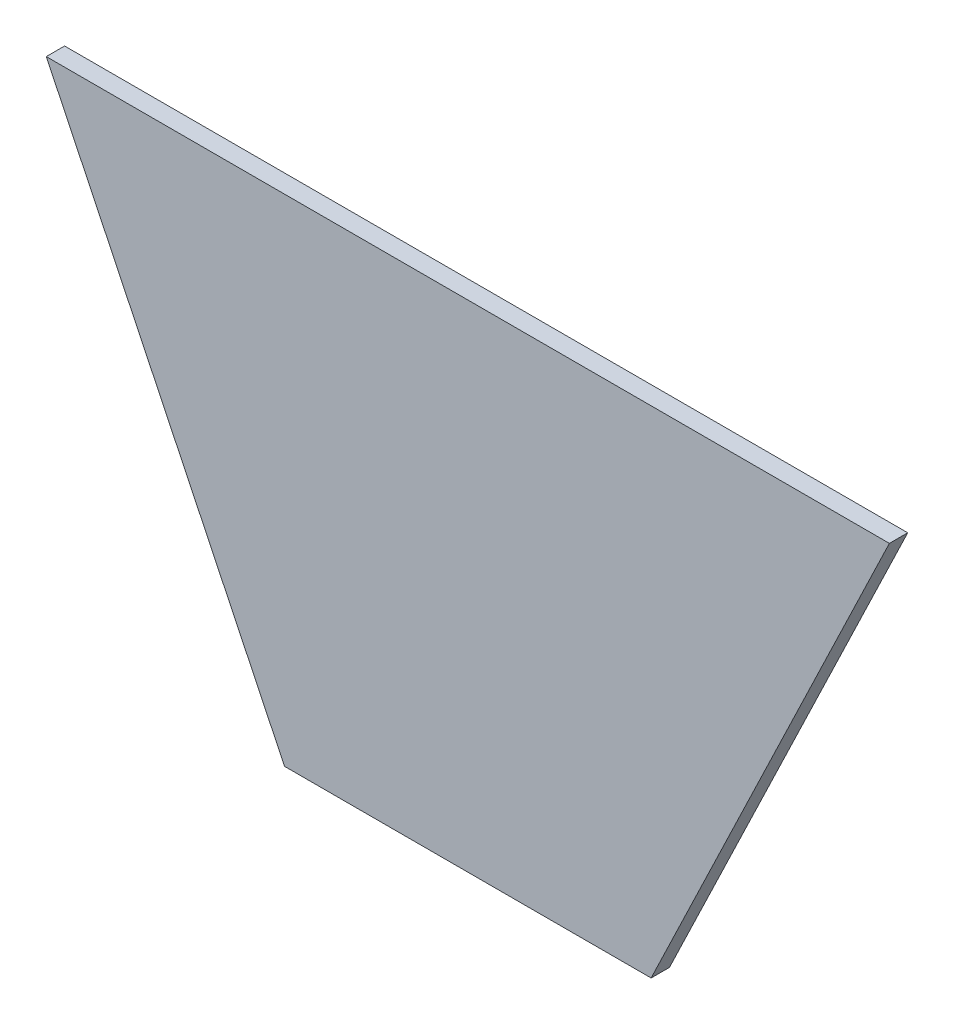
ISO-10303-21;
HEADER;
FILE_DESCRIPTION(('STEP AP214'),'2;1');
FILE_NAME('part.step','',(''),(''),'','','');
FILE_SCHEMA(('AUTOMOTIVE_DESIGN { 1 0 10303 214 1 1 1 1 }'));
ENDSEC;
DATA;
#1=APPLICATION_CONTEXT('core data for automotive mechanical design processes');
#2=APPLICATION_PROTOCOL_DEFINITION('international standard','automotive_design',2000,#1);
#3=PRODUCT_CONTEXT('',#1,'mechanical');
#4=PRODUCT('Part','Part','',(#3));
#5=PRODUCT_RELATED_PRODUCT_CATEGORY('part','',(#4));
#6=PRODUCT_DEFINITION_FORMATION('','',#4);
#7=PRODUCT_DEFINITION_CONTEXT('part definition',#1,'design');
#8=PRODUCT_DEFINITION('design','',#6,#7);
#9=PRODUCT_DEFINITION_SHAPE('','',#8);
#10=(LENGTH_UNIT() NAMED_UNIT(*) SI_UNIT(.MILLI.,.METRE.));
#11=(NAMED_UNIT(*) PLANE_ANGLE_UNIT() SI_UNIT($,.RADIAN.));
#12=(NAMED_UNIT(*) SI_UNIT($,.STERADIAN.) SOLID_ANGLE_UNIT());
#13=UNCERTAINTY_MEASURE_WITH_UNIT(LENGTH_MEASURE(1.E-05),#10,'distance_accuracy_value','');
#14=(GEOMETRIC_REPRESENTATION_CONTEXT(3) GLOBAL_UNCERTAINTY_ASSIGNED_CONTEXT((#13)) GLOBAL_UNIT_ASSIGNED_CONTEXT((#10,
#11,#12)) REPRESENTATION_CONTEXT('',''));
#15=CARTESIAN_POINT('',(0.,0.,0.));
#16=DIRECTION('',(0.,0.,1.));
#17=DIRECTION('',(1.,0.,0.));
#18=AXIS2_PLACEMENT_3D('',#15,#16,#17);
#19=CARTESIAN_POINT('',(-230.,270.370116691916,10.));
#20=DIRECTION('',(0.901233722306385,0.433333333333333,0.));
#21=DIRECTION('',(-0.433333333333333,0.901233722306385,0.));
#22=AXIS2_PLACEMENT_3D('',#19,#20,#21);
#23=PLANE('',#22);
#24=DIRECTION('',(0.433333333333333,-0.901233722306385,0.));
#25=VECTOR('',#24,1.);
#26=CARTESIAN_POINT('',(-230.,270.370116691916,0.));
#27=LINE('',#26,#25);
#28=CARTESIAN_POINT('',(-230.,270.370116691916,0.));
#29=VERTEX_POINT('',#28);
#30=CARTESIAN_POINT('',(-100.,0.,0.));
#31=VERTEX_POINT('',#30);
#32=EDGE_CURVE('E107',#29,#31,#27,.T.);
#33=ORIENTED_EDGE('',*,*,#32,.T.);
#34=DIRECTION('',(0.,0.,-1.));
#35=VECTOR('',#34,1.);
#36=CARTESIAN_POINT('',(-100.,0.,10.));
#37=LINE('',#36,#35);
#38=CARTESIAN_POINT('',(-100.,0.,10.));
#39=VERTEX_POINT('',#38);
#40=EDGE_CURVE('E11',#39,#31,#37,.T.);
#41=ORIENTED_EDGE('',*,*,#40,.F.);
#42=DIRECTION('',(0.433333333333333,-0.901233722306385,0.));
#43=VECTOR('',#42,1.);
#44=CARTESIAN_POINT('',(-230.,270.370116691916,10.));
#45=LINE('',#44,#43);
#46=CARTESIAN_POINT('',(-230.,270.370116691916,10.));
#47=VERTEX_POINT('',#46);
#48=EDGE_CURVE('E91',#47,#39,#45,.T.);
#49=ORIENTED_EDGE('',*,*,#48,.F.);
#50=DIRECTION('',(0.,0.,-1.));
#51=VECTOR('',#50,1.);
#52=CARTESIAN_POINT('',(-230.,270.370116691916,10.));
#53=LINE('',#52,#51);
#54=EDGE_CURVE('E103',#47,#29,#53,.T.);
#55=ORIENTED_EDGE('',*,*,#54,.T.);
#56=EDGE_LOOP('',(#33,#41,#49,#55));
#57=FACE_BOUND('',#56,.T.);
#58=ADVANCED_FACE('F39',(#57),#23,.F.);
#59=CARTESIAN_POINT('',(-100.,0.,10.));
#60=DIRECTION('',(0.,1.,0.));
#61=DIRECTION('',(0.,0.,1.));
#62=AXIS2_PLACEMENT_3D('',#59,#60,#61);
#63=PLANE('',#62);
#64=DIRECTION('',(1.,0.,0.));
#65=VECTOR('',#64,1.);
#66=CARTESIAN_POINT('',(-100.,0.,0.));
#67=LINE('',#66,#65);
#68=CARTESIAN_POINT('',(100.,0.,0.));
#69=VERTEX_POINT('',#68);
#70=EDGE_CURVE('E96',#31,#69,#67,.T.);
#71=ORIENTED_EDGE('',*,*,#70,.T.);
#72=DIRECTION('',(0.,0.,-1.));
#73=VECTOR('',#72,1.);
#74=CARTESIAN_POINT('',(100.,0.,10.));
#75=LINE('',#74,#73);
#76=CARTESIAN_POINT('',(100.,0.,10.));
#77=VERTEX_POINT('',#76);
#78=EDGE_CURVE('E48',#77,#69,#75,.T.);
#79=ORIENTED_EDGE('',*,*,#78,.F.);
#80=DIRECTION('',(1.,0.,0.));
#81=VECTOR('',#80,1.);
#82=CARTESIAN_POINT('',(-100.,0.,10.));
#83=LINE('',#82,#81);
#84=EDGE_CURVE('E86',#39,#77,#83,.T.);
#85=ORIENTED_EDGE('',*,*,#84,.F.);
#86=ORIENTED_EDGE('',*,*,#40,.T.);
#87=EDGE_LOOP('',(#71,#79,#85,#86));
#88=FACE_BOUND('',#87,.T.);
#89=ADVANCED_FACE('F95',(#88),#63,.F.);
#90=CARTESIAN_POINT('',(100.,0.,10.));
#91=DIRECTION('',(-0.901233722306385,0.433333333333334,0.));
#92=DIRECTION('',(-0.433333333333334,-0.901233722306385,0.));
#93=AXIS2_PLACEMENT_3D('',#90,#91,#92);
#94=PLANE('',#93);
#95=DIRECTION('',(0.433333333333334,0.901233722306385,0.));
#96=VECTOR('',#95,1.);
#97=CARTESIAN_POINT('',(100.,0.,0.));
#98=LINE('',#97,#96);
#99=CARTESIAN_POINT('',(230.,270.370116691915,0.));
#100=VERTEX_POINT('',#99);
#101=EDGE_CURVE('E73',#69,#100,#98,.T.);
#102=ORIENTED_EDGE('',*,*,#101,.T.);
#103=DIRECTION('',(0.,0.,-1.));
#104=VECTOR('',#103,1.);
#105=CARTESIAN_POINT('',(230.,270.370116691915,10.));
#106=LINE('',#105,#104);
#107=CARTESIAN_POINT('',(230.,270.370116691915,10.));
#108=VERTEX_POINT('',#107);
#109=EDGE_CURVE('E98',#108,#100,#106,.T.);
#110=ORIENTED_EDGE('',*,*,#109,.F.);
#111=DIRECTION('',(0.433333333333334,0.901233722306385,0.));
#112=VECTOR('',#111,1.);
#113=CARTESIAN_POINT('',(100.,0.,10.));
#114=LINE('',#113,#112);
#115=EDGE_CURVE('E89',#77,#108,#114,.T.);
#116=ORIENTED_EDGE('',*,*,#115,.F.);
#117=ORIENTED_EDGE('',*,*,#78,.T.);
#118=EDGE_LOOP('',(#102,#110,#116,#117));
#119=FACE_BOUND('',#118,.T.);
#120=ADVANCED_FACE('F99',(#119),#94,.F.);
#121=CARTESIAN_POINT('',(230.,270.370116691915,10.));
#122=DIRECTION('',(0.,-1.,0.));
#123=DIRECTION('',(1.,0.,0.));
#124=AXIS2_PLACEMENT_3D('',#121,#122,#123);
#125=PLANE('',#124);
#126=DIRECTION('',(-1.,0.,0.));
#127=VECTOR('',#126,1.);
#128=CARTESIAN_POINT('',(230.,270.370116691915,0.));
#129=LINE('',#128,#127);
#130=EDGE_CURVE('E79',#100,#29,#129,.T.);
#131=ORIENTED_EDGE('',*,*,#130,.T.);
#132=ORIENTED_EDGE('',*,*,#54,.F.);
#133=DIRECTION('',(-1.,0.,0.));
#134=VECTOR('',#133,1.);
#135=CARTESIAN_POINT('',(230.,270.370116691915,10.));
#136=LINE('',#135,#134);
#137=EDGE_CURVE('E56',#108,#47,#136,.T.);
#138=ORIENTED_EDGE('',*,*,#137,.F.);
#139=ORIENTED_EDGE('',*,*,#109,.T.);
#140=EDGE_LOOP('',(#131,#132,#138,#139));
#141=FACE_BOUND('',#140,.T.);
#142=ADVANCED_FACE('F120',(#141),#125,.F.);
#143=CARTESIAN_POINT('',(0.,0.,10.));
#144=DIRECTION('',(0.,0.,1.));
#145=DIRECTION('',(1.,0.,0.));
#146=AXIS2_PLACEMENT_3D('',#143,#144,#145);
#147=PLANE('',#146);
#148=ORIENTED_EDGE('',*,*,#48,.T.);
#149=ORIENTED_EDGE('',*,*,#84,.T.);
#150=ORIENTED_EDGE('',*,*,#115,.T.);
#151=ORIENTED_EDGE('',*,*,#137,.T.);
#152=EDGE_LOOP('',(#148,#149,#150,#151));
#153=FACE_BOUND('',#152,.T.);
#154=ADVANCED_FACE('F87',(#153),#147,.T.);
#155=CARTESIAN_POINT('',(0.,0.,0.));
#156=DIRECTION('',(0.,0.,1.));
#157=DIRECTION('',(1.,0.,0.));
#158=AXIS2_PLACEMENT_3D('',#155,#156,#157);
#159=PLANE('',#158);
#160=ORIENTED_EDGE('',*,*,#32,.F.);
#161=ORIENTED_EDGE('',*,*,#130,.F.);
#162=ORIENTED_EDGE('',*,*,#101,.F.);
#163=ORIENTED_EDGE('',*,*,#70,.F.);
#164=EDGE_LOOP('',(#160,#161,#162,#163));
#165=FACE_BOUND('',#164,.T.);
#166=ADVANCED_FACE('F123',(#165),#159,.F.);
#167=CLOSED_SHELL('',(#58,#89,#120,#142,#154,#166));
#168=MANIFOLD_SOLID_BREP('B2',#167);
#169=ADVANCED_BREP_SHAPE_REPRESENTATION('',(#18,#168),#14);
#170=SHAPE_DEFINITION_REPRESENTATION(#9,#169);
ENDSEC;
END-ISO-10303-21;
